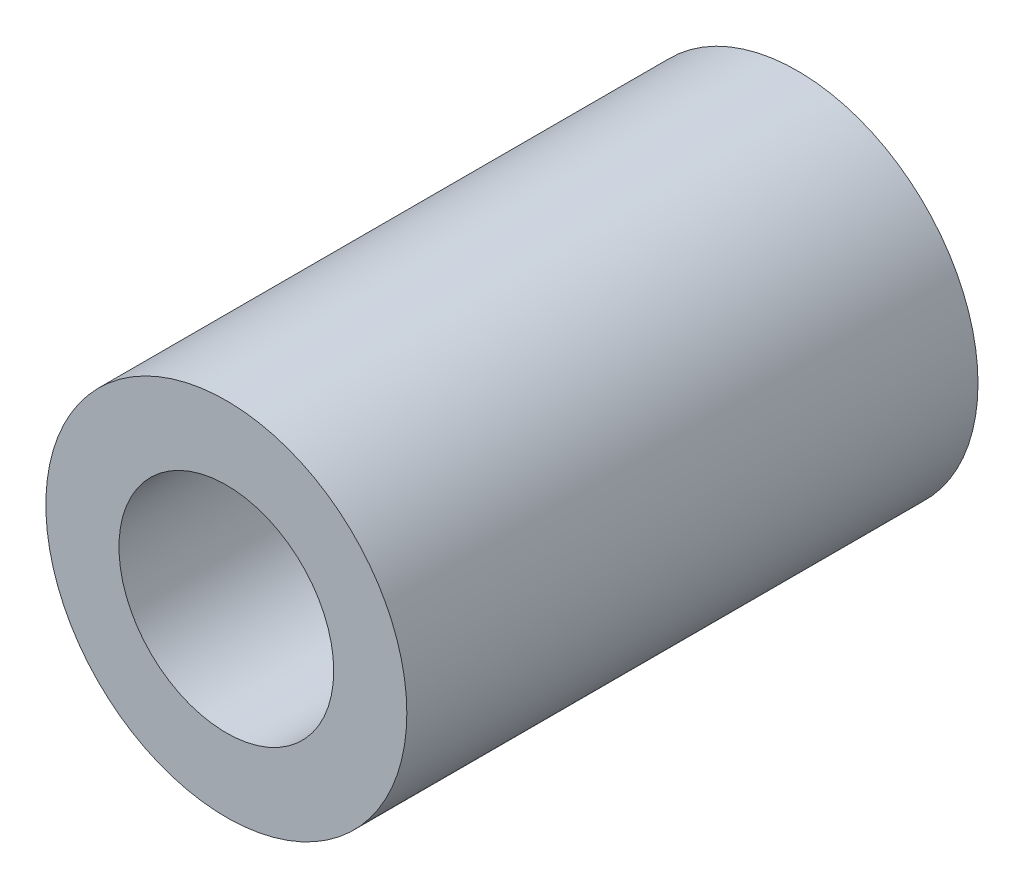
ISO-10303-21;
HEADER;
FILE_DESCRIPTION(('STEP AP214'),'2;1');
FILE_NAME('part.step','',(''),(''),'','','');
FILE_SCHEMA(('AUTOMOTIVE_DESIGN { 1 0 10303 214 1 1 1 1 }'));
ENDSEC;
DATA;
#1=APPLICATION_CONTEXT('core data for automotive mechanical design processes');
#2=APPLICATION_PROTOCOL_DEFINITION('international standard','automotive_design',2000,#1);
#3=PRODUCT_CONTEXT('',#1,'mechanical');
#4=PRODUCT('Part','Part','',(#3));
#5=PRODUCT_RELATED_PRODUCT_CATEGORY('part','',(#4));
#6=PRODUCT_DEFINITION_FORMATION('','',#4);
#7=PRODUCT_DEFINITION_CONTEXT('part definition',#1,'design');
#8=PRODUCT_DEFINITION('design','',#6,#7);
#9=PRODUCT_DEFINITION_SHAPE('','',#8);
#10=(LENGTH_UNIT() NAMED_UNIT(*) SI_UNIT(.MILLI.,.METRE.));
#11=(NAMED_UNIT(*) PLANE_ANGLE_UNIT() SI_UNIT($,.RADIAN.));
#12=(NAMED_UNIT(*) SI_UNIT($,.STERADIAN.) SOLID_ANGLE_UNIT());
#13=UNCERTAINTY_MEASURE_WITH_UNIT(LENGTH_MEASURE(1.E-05),#10,'distance_accuracy_value','');
#14=(GEOMETRIC_REPRESENTATION_CONTEXT(3) GLOBAL_UNCERTAINTY_ASSIGNED_CONTEXT((#13)) GLOBAL_UNIT_ASSIGNED_CONTEXT((#10,
#11,#12)) REPRESENTATION_CONTEXT('',''));
#15=CARTESIAN_POINT('',(0.,0.,0.));
#16=DIRECTION('',(0.,0.,1.));
#17=DIRECTION('',(1.,0.,0.));
#18=AXIS2_PLACEMENT_3D('',#15,#16,#17);
#19=CARTESIAN_POINT('',(0.,0.,-25.));
#20=DIRECTION('',(0.,0.,1.));
#21=DIRECTION('',(1.,0.,0.));
#22=AXIS2_PLACEMENT_3D('',#19,#20,#21);
#23=CYLINDRICAL_SURFACE('',#22,7.9);
#24=CARTESIAN_POINT('',(0.,0.,-25.));
#25=DIRECTION('',(0.,0.,1.));
#26=DIRECTION('',(1.,0.,0.));
#27=AXIS2_PLACEMENT_3D('',#24,#25,#26);
#28=CIRCLE('',#27,7.9);
#29=CARTESIAN_POINT('',(7.9,0.,-25.));
#30=VERTEX_POINT('',#29);
#31=EDGE_CURVE('E10',#30,#30,#28,.T.);
#32=ORIENTED_EDGE('',*,*,#31,.T.);
#33=EDGE_LOOP('',(#32));
#34=FACE_BOUND('',#33,.T.);
#35=CARTESIAN_POINT('',(0.,0.,0.));
#36=DIRECTION('',(0.,0.,1.));
#37=DIRECTION('',(1.,0.,0.));
#38=AXIS2_PLACEMENT_3D('',#35,#36,#37);
#39=CIRCLE('',#38,7.9);
#40=CARTESIAN_POINT('',(7.9,0.,0.));
#41=VERTEX_POINT('',#40);
#42=EDGE_CURVE('E34',#41,#41,#39,.T.);
#43=ORIENTED_EDGE('',*,*,#42,.F.);
#44=EDGE_LOOP('',(#43));
#45=FACE_BOUND('',#44,.T.);
#46=ADVANCED_FACE('F31',(#34,#45),#23,.T.);
#47=CARTESIAN_POINT('',(0.,0.,-25.));
#48=DIRECTION('',(0.,0.,1.));
#49=DIRECTION('',(1.,0.,0.));
#50=AXIS2_PLACEMENT_3D('',#47,#48,#49);
#51=PLANE('',#50);
#52=CARTESIAN_POINT('',(0.,0.,-25.));
#53=DIRECTION('',(0.,0.,1.));
#54=DIRECTION('',(1.,0.,0.));
#55=AXIS2_PLACEMENT_3D('',#52,#53,#54);
#56=CIRCLE('',#55,4.7);
#57=CARTESIAN_POINT('',(4.7,0.,-25.));
#58=VERTEX_POINT('',#57);
#59=EDGE_CURVE('E41',#58,#58,#56,.T.);
#60=ORIENTED_EDGE('',*,*,#59,.T.);
#61=EDGE_LOOP('',(#60));
#62=FACE_BOUND('',#61,.T.);
#63=ORIENTED_EDGE('',*,*,#31,.F.);
#64=EDGE_LOOP('',(#63));
#65=FACE_BOUND('',#64,.T.);
#66=ADVANCED_FACE('F49',(#62,#65),#51,.F.);
#67=CARTESIAN_POINT('',(0.,0.,0.));
#68=DIRECTION('',(0.,0.,1.));
#69=DIRECTION('',(1.,0.,0.));
#70=AXIS2_PLACEMENT_3D('',#67,#68,#69);
#71=PLANE('',#70);
#72=CARTESIAN_POINT('',(0.,0.,0.));
#73=DIRECTION('',(0.,0.,1.));
#74=DIRECTION('',(1.,0.,0.));
#75=AXIS2_PLACEMENT_3D('',#72,#73,#74);
#76=CIRCLE('',#75,4.7);
#77=CARTESIAN_POINT('',(4.7,0.,0.));
#78=VERTEX_POINT('',#77);
#79=EDGE_CURVE('E43',#78,#78,#76,.T.);
#80=ORIENTED_EDGE('',*,*,#79,.F.);
#81=EDGE_LOOP('',(#80));
#82=FACE_BOUND('',#81,.T.);
#83=ORIENTED_EDGE('',*,*,#42,.T.);
#84=EDGE_LOOP('',(#83));
#85=FACE_BOUND('',#84,.T.);
#86=ADVANCED_FACE('F55',(#82,#85),#71,.T.);
#87=CARTESIAN_POINT('',(0.,0.,-25.));
#88=DIRECTION('',(0.,0.,1.));
#89=DIRECTION('',(1.,0.,0.));
#90=AXIS2_PLACEMENT_3D('',#87,#88,#89);
#91=CYLINDRICAL_SURFACE('',#90,4.7);
#92=ORIENTED_EDGE('',*,*,#59,.F.);
#93=EDGE_LOOP('',(#92));
#94=FACE_BOUND('',#93,.T.);
#95=ORIENTED_EDGE('',*,*,#79,.T.);
#96=EDGE_LOOP('',(#95));
#97=FACE_BOUND('',#96,.T.);
#98=ADVANCED_FACE('F52',(#94,#97),#91,.F.);
#99=CLOSED_SHELL('',(#46,#66,#86,#98));
#100=MANIFOLD_SOLID_BREP('B2',#99);
#101=ADVANCED_BREP_SHAPE_REPRESENTATION('',(#18,#100),#14);
#102=SHAPE_DEFINITION_REPRESENTATION(#9,#101);
ENDSEC;
END-ISO-10303-21;
